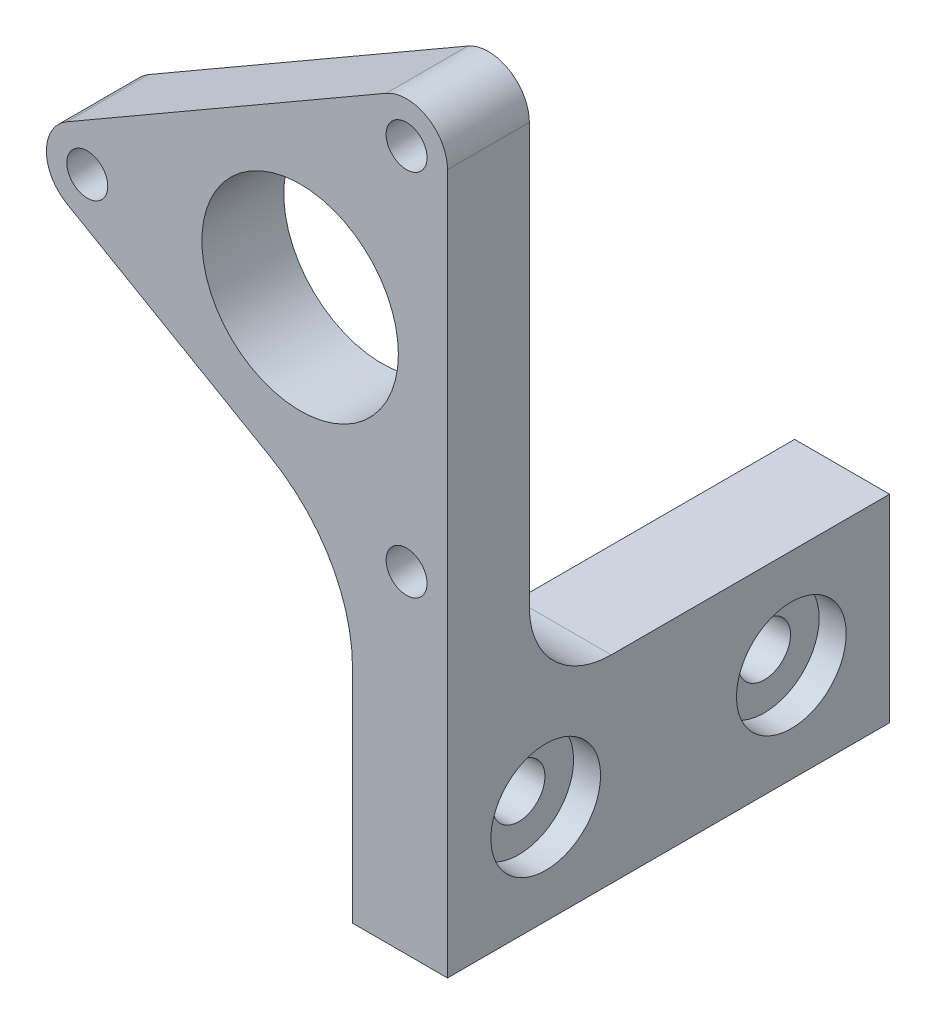
ISO-10303-21;
HEADER;
FILE_DESCRIPTION(('STEP AP214'),'2;1');
FILE_NAME('part.step','',(''),(''),'','','');
FILE_SCHEMA(('AUTOMOTIVE_DESIGN { 1 0 10303 214 1 1 1 1 }'));
ENDSEC;
DATA;
#1=APPLICATION_CONTEXT('core data for automotive mechanical design processes');
#2=APPLICATION_PROTOCOL_DEFINITION('international standard','automotive_design',2000,#1);
#3=PRODUCT_CONTEXT('',#1,'mechanical');
#4=PRODUCT('Part','Part','',(#3));
#5=PRODUCT_RELATED_PRODUCT_CATEGORY('part','',(#4));
#6=PRODUCT_DEFINITION_FORMATION('','',#4);
#7=PRODUCT_DEFINITION_CONTEXT('part definition',#1,'design');
#8=PRODUCT_DEFINITION('design','',#6,#7);
#9=PRODUCT_DEFINITION_SHAPE('','',#8);
#10=(LENGTH_UNIT() NAMED_UNIT(*) SI_UNIT(.MILLI.,.METRE.));
#11=(NAMED_UNIT(*) PLANE_ANGLE_UNIT() SI_UNIT($,.RADIAN.));
#12=(NAMED_UNIT(*) SI_UNIT($,.STERADIAN.) SOLID_ANGLE_UNIT());
#13=UNCERTAINTY_MEASURE_WITH_UNIT(LENGTH_MEASURE(1.E-05),#10,'distance_accuracy_value','');
#14=(GEOMETRIC_REPRESENTATION_CONTEXT(3) GLOBAL_UNCERTAINTY_ASSIGNED_CONTEXT((#13)) GLOBAL_UNIT_ASSIGNED_CONTEXT((#10,
#11,#12)) REPRESENTATION_CONTEXT('',''));
#15=CARTESIAN_POINT('',(0.,0.,0.));
#16=DIRECTION('',(0.,0.,1.));
#17=DIRECTION('',(1.,0.,0.));
#18=AXIS2_PLACEMENT_3D('',#15,#16,#17);
#19=CARTESIAN_POINT('',(9.00000000000005,11.2583302491977,5.));
#20=DIRECTION('',(-1.,0.,0.));
#21=DIRECTION('',(0.,-1.,0.));
#22=AXIS2_PLACEMENT_3D('',#19,#20,#21);
#23=PLANE('',#22);
#24=CARTESIAN_POINT('',(9.00000000000007,-25.4533302491977,-16.));
#25=DIRECTION('',(1.,0.,0.));
#26=DIRECTION('',(0.,0.,-1.));
#27=AXIS2_PLACEMENT_3D('',#24,#25,#26);
#28=CIRCLE('',#27,3.35);
#29=CARTESIAN_POINT('',(9.00000000000007,-25.4533302491977,-19.35));
#30=VERTEX_POINT('',#29);
#31=EDGE_CURVE('E311',#30,#30,#28,.T.);
#32=ORIENTED_EDGE('',*,*,#31,.F.);
#33=EDGE_LOOP('',(#32));
#34=FACE_BOUND('',#33,.T.);
#35=DIRECTION('',(0.,0.,-1.));
#36=VECTOR('',#35,1.);
#37=CARTESIAN_POINT('',(9.00000000000006,-31.4983302491977,5.));
#38=LINE('',#37,#36);
#39=CARTESIAN_POINT('',(9.00000000000006,-31.4983302491977,5.));
#40=VERTEX_POINT('',#39);
#41=CARTESIAN_POINT('',(9.00000000000006,-31.4983302491977,-22.));
#42=VERTEX_POINT('',#41);
#43=EDGE_CURVE('E123',#40,#42,#38,.T.);
#44=ORIENTED_EDGE('',*,*,#43,.T.);
#45=DIRECTION('',(0.,-1.,0.));
#46=VECTOR('',#45,1.);
#47=CARTESIAN_POINT('',(9.00000000000006,-19.4083302491977,-22.));
#48=LINE('',#47,#46);
#49=CARTESIAN_POINT('',(9.00000000000006,-19.4083302491977,-22.));
#50=VERTEX_POINT('',#49);
#51=EDGE_CURVE('E137',#50,#42,#48,.T.);
#52=ORIENTED_EDGE('',*,*,#51,.F.);
#53=DIRECTION('',(0.,0.,1.));
#54=VECTOR('',#53,1.);
#55=CARTESIAN_POINT('',(9.00000000000006,-19.4083302491977,-22.));
#56=LINE('',#55,#54);
#57=CARTESIAN_POINT('',(9.00000000000006,-19.4083302491977,-5.));
#58=VERTEX_POINT('',#57);
#59=EDGE_CURVE('E147',#50,#58,#56,.T.);
#60=ORIENTED_EDGE('',*,*,#59,.T.);
#61=CARTESIAN_POINT('',(9.00000000000006,-14.4083302491977,-5.));
#62=DIRECTION('',(-1.,0.,0.));
#63=DIRECTION('',(0.,-1.,0.));
#64=AXIS2_PLACEMENT_3D('',#61,#62,#63);
#65=CIRCLE('',#64,5.);
#66=CARTESIAN_POINT('',(9.00000000000006,-14.4083302491977,0.));
#67=VERTEX_POINT('',#66);
#68=EDGE_CURVE('E55',#58,#67,#65,.T.);
#69=ORIENTED_EDGE('',*,*,#68,.T.);
#70=DIRECTION('',(0.,1.,0.));
#71=VECTOR('',#70,1.);
#72=CARTESIAN_POINT('',(9.00000000000005,11.2583302491977,0.));
#73=LINE('',#72,#71);
#74=CARTESIAN_POINT('',(9.00000000000005,11.2583302491977,0.));
#75=VERTEX_POINT('',#74);
#76=EDGE_CURVE('E193',#67,#75,#73,.T.);
#77=ORIENTED_EDGE('',*,*,#76,.T.);
#78=DIRECTION('',(0.,0.,-1.));
#79=VECTOR('',#78,1.);
#80=CARTESIAN_POINT('',(9.00000000000005,11.2583302491977,5.));
#81=LINE('',#80,#79);
#82=CARTESIAN_POINT('',(9.00000000000005,11.2583302491977,5.));
#83=VERTEX_POINT('',#82);
#84=EDGE_CURVE('E325',#83,#75,#81,.T.);
#85=ORIENTED_EDGE('',*,*,#84,.F.);
#86=DIRECTION('',(0.,1.,0.));
#87=VECTOR('',#86,1.);
#88=CARTESIAN_POINT('',(9.00000000000006,-11.2583302491977,5.));
#89=LINE('',#88,#87);
#90=EDGE_CURVE('E180',#40,#83,#89,.T.);
#91=ORIENTED_EDGE('',*,*,#90,.F.);
#92=EDGE_LOOP('',(#44,#52,#60,#69,#77,#85,#91));
#93=FACE_BOUND('',#92,.T.);
#94=CARTESIAN_POINT('',(9.00000000000007,-25.4533302491977,-1.));
#95=DIRECTION('',(1.,0.,0.));
#96=DIRECTION('',(0.,0.,-1.));
#97=AXIS2_PLACEMENT_3D('',#94,#95,#96);
#98=CIRCLE('',#97,3.35);
#99=CARTESIAN_POINT('',(9.00000000000007,-25.4533302491977,-4.35));
#100=VERTEX_POINT('',#99);
#101=EDGE_CURVE('E300',#100,#100,#98,.T.);
#102=ORIENTED_EDGE('',*,*,#101,.F.);
#103=EDGE_LOOP('',(#102));
#104=FACE_BOUND('',#103,.T.);
#105=ADVANCED_FACE('F32',(#34,#93,#104),#23,.F.);
#106=CARTESIAN_POINT('',(-6.79999999999994,-18.0133283987163,0.));
#107=DIRECTION('',(0.,0.,1.));
#108=DIRECTION('',(1.,0.,0.));
#109=AXIS2_PLACEMENT_3D('',#106,#107,#108);
#110=PLANE('',#109);
#111=CARTESIAN_POINT('',(-13.,0.,0.));
#112=DIRECTION('',(0.,0.,1.));
#113=DIRECTION('',(1.,0.,0.));
#114=AXIS2_PLACEMENT_3D('',#111,#112,#113);
#115=CIRCLE('',#114,1.25);
#116=CARTESIAN_POINT('',(-11.75,0.,0.));
#117=VERTEX_POINT('',#116);
#118=EDGE_CURVE('E152',#117,#117,#115,.T.);
#119=ORIENTED_EDGE('',*,*,#118,.T.);
#120=EDGE_LOOP('',(#119));
#121=FACE_BOUND('',#120,.T.);
#122=CARTESIAN_POINT('',(6.50000000000006,-11.2583302491977,0.));
#123=DIRECTION('',(0.,0.,1.));
#124=DIRECTION('',(1.,0.,0.));
#125=AXIS2_PLACEMENT_3D('',#122,#123,#124);
#126=CIRCLE('',#125,1.25);
#127=CARTESIAN_POINT('',(7.75000000000006,-11.2583302491977,0.));
#128=VERTEX_POINT('',#127);
#129=EDGE_CURVE('E158',#128,#128,#126,.T.);
#130=ORIENTED_EDGE('',*,*,#129,.T.);
#131=EDGE_LOOP('',(#130));
#132=FACE_BOUND('',#131,.T.);
#133=CARTESIAN_POINT('',(0.,0.,0.));
#134=DIRECTION('',(0.,0.,1.));
#135=DIRECTION('',(1.,0.,0.));
#136=AXIS2_PLACEMENT_3D('',#133,#134,#135);
#137=CIRCLE('',#136,6.);
#138=CARTESIAN_POINT('',(6.,0.,0.));
#139=VERTEX_POINT('',#138);
#140=EDGE_CURVE('E164',#139,#139,#137,.T.);
#141=ORIENTED_EDGE('',*,*,#140,.T.);
#142=EDGE_LOOP('',(#141));
#143=FACE_BOUND('',#142,.T.);
#144=CARTESIAN_POINT('',(6.50000000000005,11.2583302491977,0.));
#145=DIRECTION('',(0.,0.,1.));
#146=DIRECTION('',(1.,0.,0.));
#147=AXIS2_PLACEMENT_3D('',#144,#145,#146);
#148=CIRCLE('',#147,1.25);
#149=CARTESIAN_POINT('',(7.75000000000005,11.2583302491977,0.));
#150=VERTEX_POINT('',#149);
#151=EDGE_CURVE('E151',#150,#150,#148,.T.);
#152=ORIENTED_EDGE('',*,*,#151,.T.);
#153=EDGE_LOOP('',(#152));
#154=FACE_BOUND('',#153,.T.);
#155=ORIENTED_EDGE('',*,*,#76,.F.);
#156=DIRECTION('',(1.,0.,0.));
#157=VECTOR('',#156,1.);
#158=CARTESIAN_POINT('',(3.20000000000006,-14.4083302491977,0.));
#159=LINE('',#158,#157);
#160=CARTESIAN_POINT('',(2.52759284820946,-14.4083302491977,0.));
#161=VERTEX_POINT('',#160);
#162=EDGE_CURVE('E203',#67,#161,#159,.F.);
#163=ORIENTED_EDGE('',*,*,#162,.T.);
#164=CARTESIAN_POINT('',(-6.79999999999994,-18.0133283987163,0.));
#165=DIRECTION('',(0.,0.,-1.));
#166=DIRECTION('',(1.,0.,0.));
#167=AXIS2_PLACEMENT_3D('',#164,#165,#166);
#168=CIRCLE('',#167,10.);
#169=CARTESIAN_POINT('',(-1.79999999999997,-9.35307436087192,0.));
#170=VERTEX_POINT('',#169);
#171=EDGE_CURVE('E170',#170,#161,#168,.T.);
#172=ORIENTED_EDGE('',*,*,#171,.F.);
#173=DIRECTION('',(0.86602540378444,-0.499999999999998,0.));
#174=VECTOR('',#173,1.);
#175=CARTESIAN_POINT('',(-14.25,-2.1650635094611,0.));
#176=LINE('',#175,#174);
#177=CARTESIAN_POINT('',(-14.25,-2.1650635094611,0.));
#178=VERTEX_POINT('',#177);
#179=EDGE_CURVE('E177',#178,#170,#176,.T.);
#180=ORIENTED_EDGE('',*,*,#179,.F.);
#181=CARTESIAN_POINT('',(-13.,0.,0.));
#182=DIRECTION('',(0.,0.,1.));
#183=DIRECTION('',(1.,0.,0.));
#184=AXIS2_PLACEMENT_3D('',#181,#182,#183);
#185=CIRCLE('',#184,2.5);
#186=CARTESIAN_POINT('',(-14.25,2.1650635094611,0.));
#187=VERTEX_POINT('',#186);
#188=EDGE_CURVE('E368',#187,#178,#185,.T.);
#189=ORIENTED_EDGE('',*,*,#188,.F.);
#190=DIRECTION('',(-0.86602540378444,-0.499999999999998,0.));
#191=VECTOR('',#190,1.);
#192=CARTESIAN_POINT('',(-14.25,2.1650635094611,0.));
#193=LINE('',#192,#191);
#194=CARTESIAN_POINT('',(5.25000000000006,13.4233937586588,0.));
#195=VERTEX_POINT('',#194);
#196=EDGE_CURVE('E365',#195,#187,#193,.T.);
#197=ORIENTED_EDGE('',*,*,#196,.F.);
#198=CARTESIAN_POINT('',(6.50000000000004,11.2583302491977,0.));
#199=DIRECTION('',(0.,0.,1.));
#200=DIRECTION('',(-1.,0.,0.));
#201=AXIS2_PLACEMENT_3D('',#198,#199,#200);
#202=CIRCLE('',#201,2.50000000000001);
#203=EDGE_CURVE('E196',#75,#195,#202,.T.);
#204=ORIENTED_EDGE('',*,*,#203,.F.);
#205=EDGE_LOOP('',(#155,#163,#172,#180,#189,#197,#204));
#206=FACE_BOUND('',#205,.T.);
#207=ADVANCED_FACE('F222',(#121,#132,#143,#154,#206),#110,.F.);
#208=CARTESIAN_POINT('',(-6.79999999999994,-18.0133283987163,5.));
#209=DIRECTION('',(0.,0.,1.));
#210=DIRECTION('',(1.,0.,0.));
#211=AXIS2_PLACEMENT_3D('',#208,#209,#210);
#212=PLANE('',#211);
#213=CARTESIAN_POINT('',(6.50000000000005,11.2583302491977,5.));
#214=DIRECTION('',(0.,0.,1.));
#215=DIRECTION('',(1.,0.,0.));
#216=AXIS2_PLACEMENT_3D('',#213,#214,#215);
#217=CIRCLE('',#216,1.25);
#218=CARTESIAN_POINT('',(7.75000000000005,11.2583302491977,5.));
#219=VERTEX_POINT('',#218);
#220=EDGE_CURVE('E155',#219,#219,#217,.T.);
#221=ORIENTED_EDGE('',*,*,#220,.F.);
#222=EDGE_LOOP('',(#221));
#223=FACE_BOUND('',#222,.T.);
#224=CARTESIAN_POINT('',(0.,0.,5.));
#225=DIRECTION('',(0.,0.,1.));
#226=DIRECTION('',(1.,0.,0.));
#227=AXIS2_PLACEMENT_3D('',#224,#225,#226);
#228=CIRCLE('',#227,6.);
#229=CARTESIAN_POINT('',(6.,0.,5.));
#230=VERTEX_POINT('',#229);
#231=EDGE_CURVE('E167',#230,#230,#228,.T.);
#232=ORIENTED_EDGE('',*,*,#231,.F.);
#233=EDGE_LOOP('',(#232));
#234=FACE_BOUND('',#233,.T.);
#235=CARTESIAN_POINT('',(-6.79999999999994,-18.0133283987163,5.));
#236=DIRECTION('',(0.,0.,-1.));
#237=DIRECTION('',(1.,0.,0.));
#238=AXIS2_PLACEMENT_3D('',#235,#236,#237);
#239=CIRCLE('',#238,10.);
#240=CARTESIAN_POINT('',(-1.79999999999997,-9.35307436087192,5.));
#241=VERTEX_POINT('',#240);
#242=CARTESIAN_POINT('',(3.20000000000006,-18.0133283987163,5.));
#243=VERTEX_POINT('',#242);
#244=EDGE_CURVE('E173',#241,#243,#239,.T.);
#245=ORIENTED_EDGE('',*,*,#244,.T.);
#246=DIRECTION('',(0.,-1.,0.));
#247=VECTOR('',#246,1.);
#248=CARTESIAN_POINT('',(3.20000000000006,-19.4083302491977,5.));
#249=LINE('',#248,#247);
#250=CARTESIAN_POINT('',(3.20000000000006,-31.4983302491977,5.));
#251=VERTEX_POINT('',#250);
#252=EDGE_CURVE('E176',#243,#251,#249,.T.);
#253=ORIENTED_EDGE('',*,*,#252,.T.);
#254=DIRECTION('',(1.,0.,0.));
#255=VECTOR('',#254,1.);
#256=CARTESIAN_POINT('',(9.00000000000006,-31.4983302491977,5.));
#257=LINE('',#256,#255);
#258=EDGE_CURVE('E122',#251,#40,#257,.T.);
#259=ORIENTED_EDGE('',*,*,#258,.T.);
#260=ORIENTED_EDGE('',*,*,#90,.T.);
#261=CARTESIAN_POINT('',(6.50000000000004,11.2583302491977,5.));
#262=DIRECTION('',(0.,0.,1.));
#263=DIRECTION('',(-1.,0.,0.));
#264=AXIS2_PLACEMENT_3D('',#261,#262,#263);
#265=CIRCLE('',#264,2.50000000000001);
#266=CARTESIAN_POINT('',(5.25000000000006,13.4233937586588,5.));
#267=VERTEX_POINT('',#266);
#268=EDGE_CURVE('E182',#83,#267,#265,.T.);
#269=ORIENTED_EDGE('',*,*,#268,.T.);
#270=DIRECTION('',(-0.86602540378444,-0.499999999999998,0.));
#271=VECTOR('',#270,1.);
#272=CARTESIAN_POINT('',(-14.25,2.1650635094611,5.));
#273=LINE('',#272,#271);
#274=CARTESIAN_POINT('',(-14.25,2.1650635094611,5.));
#275=VERTEX_POINT('',#274);
#276=EDGE_CURVE('E184',#267,#275,#273,.T.);
#277=ORIENTED_EDGE('',*,*,#276,.T.);
#278=CARTESIAN_POINT('',(-13.,0.,5.));
#279=DIRECTION('',(0.,0.,1.));
#280=DIRECTION('',(1.,0.,0.));
#281=AXIS2_PLACEMENT_3D('',#278,#279,#280);
#282=CIRCLE('',#281,2.5);
#283=CARTESIAN_POINT('',(-14.25,-2.1650635094611,5.));
#284=VERTEX_POINT('',#283);
#285=EDGE_CURVE('E186',#275,#284,#282,.T.);
#286=ORIENTED_EDGE('',*,*,#285,.T.);
#287=DIRECTION('',(0.86602540378444,-0.499999999999998,0.));
#288=VECTOR('',#287,1.);
#289=CARTESIAN_POINT('',(-14.25,-2.1650635094611,5.));
#290=LINE('',#289,#288);
#291=EDGE_CURVE('E188',#284,#241,#290,.T.);
#292=ORIENTED_EDGE('',*,*,#291,.T.);
#293=EDGE_LOOP('',(#245,#253,#259,#260,#269,#277,#286,#292));
#294=FACE_BOUND('',#293,.T.);
#295=CARTESIAN_POINT('',(6.50000000000006,-11.2583302491977,5.));
#296=DIRECTION('',(0.,0.,1.));
#297=DIRECTION('',(1.,0.,0.));
#298=AXIS2_PLACEMENT_3D('',#295,#296,#297);
#299=CIRCLE('',#298,1.25);
#300=CARTESIAN_POINT('',(7.75000000000006,-11.2583302491977,5.));
#301=VERTEX_POINT('',#300);
#302=EDGE_CURVE('E161',#301,#301,#299,.T.);
#303=ORIENTED_EDGE('',*,*,#302,.F.);
#304=EDGE_LOOP('',(#303));
#305=FACE_BOUND('',#304,.T.);
#306=CARTESIAN_POINT('',(-13.,0.,5.));
#307=DIRECTION('',(0.,0.,1.));
#308=DIRECTION('',(1.,0.,0.));
#309=AXIS2_PLACEMENT_3D('',#306,#307,#308);
#310=CIRCLE('',#309,1.25);
#311=CARTESIAN_POINT('',(-11.75,0.,5.));
#312=VERTEX_POINT('',#311);
#313=EDGE_CURVE('E148',#312,#312,#310,.T.);
#314=ORIENTED_EDGE('',*,*,#313,.F.);
#315=EDGE_LOOP('',(#314));
#316=FACE_BOUND('',#315,.T.);
#317=ADVANCED_FACE('F212',(#223,#234,#294,#305,#316),#212,.T.);
#318=CARTESIAN_POINT('',(-6.79999999999994,-18.0133283987163,5.));
#319=DIRECTION('',(0.,0.,-1.));
#320=DIRECTION('',(-1.,0.,0.));
#321=AXIS2_PLACEMENT_3D('',#318,#319,#320);
#322=CYLINDRICAL_SURFACE('',#321,10.);
#323=ORIENTED_EDGE('',*,*,#171,.T.);
#324=CARTESIAN_POINT('',(2.52759284820946,-14.4083302491977,0.));
#325=CARTESIAN_POINT('',(2.57505349169204,-14.5310702691906,1.8176382911117E-05));
#326=CARTESIAN_POINT('',(2.62006035560793,-14.6547848229578,-0.0045193791678772));
#327=CARTESIAN_POINT('',(2.70498878101354,-14.9032929106537,-0.0230034729052741));
#328=CARTESIAN_POINT('',(2.74490870994727,-15.0280867773149,-0.0369530226980955));
#329=CARTESIAN_POINT('',(2.8194060029538,-15.2776398913905,-0.0745343519197054));
#330=CARTESIAN_POINT('',(2.85399030556006,-15.402398969535,-0.0981534083253944));
#331=CARTESIAN_POINT('',(2.91781590553004,-15.6510170209932,-0.155209998934137));
#332=CARTESIAN_POINT('',(2.94705803824179,-15.77487613212,-0.188645995939753));
#333=CARTESIAN_POINT('',(3.00033372633877,-16.0210035107996,-0.265451563331926));
#334=CARTESIAN_POINT('',(3.0243530451927,-16.1432665968955,-0.308847638276383));
#335=CARTESIAN_POINT('',(3.06726737410603,-16.3848068781742,-0.405388326561697));
#336=CARTESIAN_POINT('',(3.08616234972129,-16.5040840532818,-0.458533005425436));
#337=CARTESIAN_POINT('',(3.11911983384258,-16.7385473067531,-0.574261078307648));
#338=CARTESIAN_POINT('',(3.13318593259965,-16.8537363672304,-0.636837409896639));
#339=CARTESIAN_POINT('',(3.15691326996856,-17.0791311119872,-0.771048407593639));
#340=CARTESIAN_POINT('',(3.16657573537836,-17.189338176473,-0.84268054375389));
#341=CARTESIAN_POINT('',(3.18353401384334,-17.4253783122695,-1.00972935043395));
#342=CARTESIAN_POINT('',(3.18997200608579,-17.5499374662948,-1.10703920463396));
#343=CARTESIAN_POINT('',(3.19820934361145,-17.7892557615898,-1.31294980793586));
#344=CARTESIAN_POINT('',(3.20001422483181,-17.9040264400041,-1.42153692060294));
#345=CARTESIAN_POINT('',(3.20000000000006,-18.0133283987163,-1.5353227651097));
#346=B_SPLINE_CURVE_WITH_KNOTS('',3,(#324,#325,#326,#327,#328,#329,#330,#331,#332,#333,#334,
#335,#336,#337,#338,#339,#340,#341,#342,#343,#344,#345),.UNSPECIFIED.,.F.,.F.,(4,2,2,2,2,2,2,2,
2,2,4),(0.,0.394720416909895,0.789567194560039,1.18389609875867,1.57816328939311,
1.97349207708858,2.36882352198817,2.76386039968484,3.15878715760525,3.63257193012094,
4.10579033024235),.UNSPECIFIED.);
#347=CARTESIAN_POINT('',(3.20000000000006,-18.0133283987163,-1.5353227651097));
#348=VERTEX_POINT('',#347);
#349=EDGE_CURVE('E41',#161,#348,#346,.T.);
#350=ORIENTED_EDGE('',*,*,#349,.T.);
#351=DIRECTION('',(0.,0.,-1.));
#352=VECTOR('',#351,1.);
#353=CARTESIAN_POINT('',(3.20000000000006,-18.0133283987163,5.));
#354=LINE('',#353,#352);
#355=EDGE_CURVE('E47',#243,#348,#354,.T.);
#356=ORIENTED_EDGE('',*,*,#355,.F.);
#357=ORIENTED_EDGE('',*,*,#244,.F.);
#358=DIRECTION('',(0.,0.,-1.));
#359=VECTOR('',#358,1.);
#360=CARTESIAN_POINT('',(-1.79999999999997,-9.35307436087192,5.));
#361=LINE('',#360,#359);
#362=EDGE_CURVE('E190',#241,#170,#361,.T.);
#363=ORIENTED_EDGE('',*,*,#362,.T.);
#364=EDGE_LOOP('',(#323,#350,#356,#357,#363));
#365=FACE_BOUND('',#364,.T.);
#366=ADVANCED_FACE('F208',(#365),#322,.F.);
#367=CARTESIAN_POINT('',(3.20000000000006,-31.4983302491977,5.));
#368=DIRECTION('',(1.,0.,0.));
#369=DIRECTION('',(0.,1.,0.));
#370=AXIS2_PLACEMENT_3D('',#367,#368,#369);
#371=PLANE('',#370);
#372=CARTESIAN_POINT('',(3.20000000000006,-25.4533302491977,-1.));
#373=DIRECTION('',(1.,0.,0.));
#374=DIRECTION('',(0.,1.,0.));
#375=AXIS2_PLACEMENT_3D('',#372,#373,#374);
#376=CIRCLE('',#375,1.6);
#377=CARTESIAN_POINT('',(3.20000000000006,-23.8533302491977,-1.));
#378=VERTEX_POINT('',#377);
#379=EDGE_CURVE('E308',#378,#378,#376,.T.);
#380=ORIENTED_EDGE('',*,*,#379,.T.);
#381=EDGE_LOOP('',(#380));
#382=FACE_BOUND('',#381,.T.);
#383=CARTESIAN_POINT('',(3.20000000000006,-25.4533302491977,-16.));
#384=DIRECTION('',(1.,0.,0.));
#385=DIRECTION('',(0.,1.,0.));
#386=AXIS2_PLACEMENT_3D('',#383,#384,#385);
#387=CIRCLE('',#386,1.6);
#388=CARTESIAN_POINT('',(3.20000000000006,-23.8533302491977,-16.));
#389=VERTEX_POINT('',#388);
#390=EDGE_CURVE('E138',#389,#389,#387,.T.);
#391=ORIENTED_EDGE('',*,*,#390,.T.);
#392=EDGE_LOOP('',(#391));
#393=FACE_BOUND('',#392,.T.);
#394=ORIENTED_EDGE('',*,*,#355,.T.);
#395=CARTESIAN_POINT('',(3.20000000000005,-14.4083302491977,-5.));
#396=DIRECTION('',(1.,0.,0.));
#397=DIRECTION('',(0.,1.,0.));
#398=AXIS2_PLACEMENT_3D('',#395,#396,#397);
#399=CIRCLE('',#398,5.);
#400=CARTESIAN_POINT('',(3.20000000000006,-19.4083302491977,-5.));
#401=VERTEX_POINT('',#400);
#402=EDGE_CURVE('E11',#348,#401,#399,.T.);
#403=ORIENTED_EDGE('',*,*,#402,.T.);
#404=DIRECTION('',(0.,0.,1.));
#405=VECTOR('',#404,1.);
#406=CARTESIAN_POINT('',(3.20000000000006,-19.4083302491977,-22.));
#407=LINE('',#406,#405);
#408=CARTESIAN_POINT('',(3.20000000000006,-19.4083302491977,-22.));
#409=VERTEX_POINT('',#408);
#410=EDGE_CURVE('E129',#409,#401,#407,.T.);
#411=ORIENTED_EDGE('',*,*,#410,.F.);
#412=DIRECTION('',(0.,1.,0.));
#413=VECTOR('',#412,1.);
#414=CARTESIAN_POINT('',(3.20000000000006,-31.4983302491977,-22.));
#415=LINE('',#414,#413);
#416=CARTESIAN_POINT('',(3.20000000000006,-31.4983302491977,-22.));
#417=VERTEX_POINT('',#416);
#418=EDGE_CURVE('E126',#417,#409,#415,.T.);
#419=ORIENTED_EDGE('',*,*,#418,.F.);
#420=DIRECTION('',(0.,0.,-1.));
#421=VECTOR('',#420,1.);
#422=CARTESIAN_POINT('',(3.20000000000006,-31.4983302491977,5.));
#423=LINE('',#422,#421);
#424=EDGE_CURVE('E116',#251,#417,#423,.T.);
#425=ORIENTED_EDGE('',*,*,#424,.F.);
#426=ORIENTED_EDGE('',*,*,#252,.F.);
#427=EDGE_LOOP('',(#394,#403,#411,#419,#425,#426));
#428=FACE_BOUND('',#427,.T.);
#429=ADVANCED_FACE('F127',(#382,#393,#428),#371,.F.);
#430=CARTESIAN_POINT('',(9.00000000000006,-31.4983302491977,5.));
#431=DIRECTION('',(0.,1.,0.));
#432=DIRECTION('',(0.,0.,1.));
#433=AXIS2_PLACEMENT_3D('',#430,#431,#432);
#434=PLANE('',#433);
#435=ORIENTED_EDGE('',*,*,#424,.T.);
#436=DIRECTION('',(-1.,0.,0.));
#437=VECTOR('',#436,1.);
#438=CARTESIAN_POINT('',(9.00000000000006,-31.4983302491977,-22.));
#439=LINE('',#438,#437);
#440=EDGE_CURVE('E121',#42,#417,#439,.T.);
#441=ORIENTED_EDGE('',*,*,#440,.F.);
#442=ORIENTED_EDGE('',*,*,#43,.F.);
#443=ORIENTED_EDGE('',*,*,#258,.F.);
#444=EDGE_LOOP('',(#435,#441,#442,#443));
#445=FACE_BOUND('',#444,.T.);
#446=ADVANCED_FACE('F118',(#445),#434,.F.);
#447=CARTESIAN_POINT('',(6.50000000000004,11.2583302491977,5.));
#448=DIRECTION('',(0.,0.,-1.));
#449=DIRECTION('',(-1.,0.,0.));
#450=AXIS2_PLACEMENT_3D('',#447,#448,#449);
#451=CYLINDRICAL_SURFACE('',#450,2.50000000000001);
#452=ORIENTED_EDGE('',*,*,#203,.T.);
#453=DIRECTION('',(0.,0.,-1.));
#454=VECTOR('',#453,1.);
#455=CARTESIAN_POINT('',(5.25000000000006,13.4233937586588,5.));
#456=LINE('',#455,#454);
#457=EDGE_CURVE('E328',#267,#195,#456,.T.);
#458=ORIENTED_EDGE('',*,*,#457,.F.);
#459=ORIENTED_EDGE('',*,*,#268,.F.);
#460=ORIENTED_EDGE('',*,*,#84,.T.);
#461=EDGE_LOOP('',(#452,#458,#459,#460));
#462=FACE_BOUND('',#461,.T.);
#463=ADVANCED_FACE('F219',(#462),#451,.T.);
#464=CARTESIAN_POINT('',(-14.25,2.1650635094611,5.));
#465=DIRECTION('',(0.499999999999998,-0.86602540378444,0.));
#466=DIRECTION('',(0.86602540378444,0.499999999999998,0.));
#467=AXIS2_PLACEMENT_3D('',#464,#465,#466);
#468=PLANE('',#467);
#469=ORIENTED_EDGE('',*,*,#196,.T.);
#470=DIRECTION('',(0.,0.,-1.));
#471=VECTOR('',#470,1.);
#472=CARTESIAN_POINT('',(-14.25,2.1650635094611,5.));
#473=LINE('',#472,#471);
#474=EDGE_CURVE('E354',#275,#187,#473,.T.);
#475=ORIENTED_EDGE('',*,*,#474,.F.);
#476=ORIENTED_EDGE('',*,*,#276,.F.);
#477=ORIENTED_EDGE('',*,*,#457,.T.);
#478=EDGE_LOOP('',(#469,#475,#476,#477));
#479=FACE_BOUND('',#478,.T.);
#480=ADVANCED_FACE('F226',(#479),#468,.F.);
#481=CARTESIAN_POINT('',(-13.,0.,5.));
#482=DIRECTION('',(0.,0.,-1.));
#483=DIRECTION('',(-1.,0.,0.));
#484=AXIS2_PLACEMENT_3D('',#481,#482,#483);
#485=CYLINDRICAL_SURFACE('',#484,2.5);
#486=ORIENTED_EDGE('',*,*,#188,.T.);
#487=DIRECTION('',(0.,0.,-1.));
#488=VECTOR('',#487,1.);
#489=CARTESIAN_POINT('',(-14.25,-2.1650635094611,5.));
#490=LINE('',#489,#488);
#491=EDGE_CURVE('E351',#284,#178,#490,.T.);
#492=ORIENTED_EDGE('',*,*,#491,.F.);
#493=ORIENTED_EDGE('',*,*,#285,.F.);
#494=ORIENTED_EDGE('',*,*,#474,.T.);
#495=EDGE_LOOP('',(#486,#492,#493,#494));
#496=FACE_BOUND('',#495,.T.);
#497=ADVANCED_FACE('F230',(#496),#485,.T.);
#498=CARTESIAN_POINT('',(-14.25,-2.1650635094611,5.));
#499=DIRECTION('',(0.499999999999998,0.86602540378444,0.));
#500=DIRECTION('',(-0.86602540378444,0.499999999999998,0.));
#501=AXIS2_PLACEMENT_3D('',#498,#499,#500);
#502=PLANE('',#501);
#503=ORIENTED_EDGE('',*,*,#179,.T.);
#504=ORIENTED_EDGE('',*,*,#362,.F.);
#505=ORIENTED_EDGE('',*,*,#291,.F.);
#506=ORIENTED_EDGE('',*,*,#491,.T.);
#507=EDGE_LOOP('',(#503,#504,#505,#506));
#508=FACE_BOUND('',#507,.T.);
#509=ADVANCED_FACE('F234',(#508),#502,.F.);
#510=CARTESIAN_POINT('',(0.,0.,5.));
#511=DIRECTION('',(0.,0.,-1.));
#512=DIRECTION('',(-1.,0.,0.));
#513=AXIS2_PLACEMENT_3D('',#510,#511,#512);
#514=CYLINDRICAL_SURFACE('',#513,6.);
#515=ORIENTED_EDGE('',*,*,#231,.T.);
#516=EDGE_LOOP('',(#515));
#517=FACE_BOUND('',#516,.T.);
#518=ORIENTED_EDGE('',*,*,#140,.F.);
#519=EDGE_LOOP('',(#518));
#520=FACE_BOUND('',#519,.T.);
#521=ADVANCED_FACE('F238',(#517,#520),#514,.F.);
#522=CARTESIAN_POINT('',(6.50000000000006,-11.2583302491977,5.));
#523=DIRECTION('',(0.,0.,-1.));
#524=DIRECTION('',(-1.,0.,0.));
#525=AXIS2_PLACEMENT_3D('',#522,#523,#524);
#526=CYLINDRICAL_SURFACE('',#525,1.25);
#527=ORIENTED_EDGE('',*,*,#302,.T.);
#528=EDGE_LOOP('',(#527));
#529=FACE_BOUND('',#528,.T.);
#530=ORIENTED_EDGE('',*,*,#129,.F.);
#531=EDGE_LOOP('',(#530));
#532=FACE_BOUND('',#531,.T.);
#533=ADVANCED_FACE('F248',(#529,#532),#526,.F.);
#534=CARTESIAN_POINT('',(6.50000000000005,11.2583302491977,5.));
#535=DIRECTION('',(0.,0.,-1.));
#536=DIRECTION('',(-1.,0.,0.));
#537=AXIS2_PLACEMENT_3D('',#534,#535,#536);
#538=CYLINDRICAL_SURFACE('',#537,1.25);
#539=ORIENTED_EDGE('',*,*,#220,.T.);
#540=EDGE_LOOP('',(#539));
#541=FACE_BOUND('',#540,.T.);
#542=ORIENTED_EDGE('',*,*,#151,.F.);
#543=EDGE_LOOP('',(#542));
#544=FACE_BOUND('',#543,.T.);
#545=ADVANCED_FACE('F252',(#541,#544),#538,.F.);
#546=CARTESIAN_POINT('',(-13.,0.,5.));
#547=DIRECTION('',(0.,0.,-1.));
#548=DIRECTION('',(-1.,0.,0.));
#549=AXIS2_PLACEMENT_3D('',#546,#547,#548);
#550=CYLINDRICAL_SURFACE('',#549,1.25);
#551=ORIENTED_EDGE('',*,*,#313,.T.);
#552=EDGE_LOOP('',(#551));
#553=FACE_BOUND('',#552,.T.);
#554=ORIENTED_EDGE('',*,*,#118,.F.);
#555=EDGE_LOOP('',(#554));
#556=FACE_BOUND('',#555,.T.);
#557=ADVANCED_FACE('F256',(#553,#556),#550,.F.);
#558=CARTESIAN_POINT('',(3.20000000000006,-19.4083302491977,-22.));
#559=DIRECTION('',(0.,-1.,0.));
#560=DIRECTION('',(0.,0.,-1.));
#561=AXIS2_PLACEMENT_3D('',#558,#559,#560);
#562=PLANE('',#561);
#563=ORIENTED_EDGE('',*,*,#410,.T.);
#564=DIRECTION('',(1.,0.,0.));
#565=VECTOR('',#564,1.);
#566=CARTESIAN_POINT('',(9.00000000000006,-19.4083302491977,-5.));
#567=LINE('',#566,#565);
#568=EDGE_CURVE('E201',#401,#58,#567,.T.);
#569=ORIENTED_EDGE('',*,*,#568,.T.);
#570=ORIENTED_EDGE('',*,*,#59,.F.);
#571=DIRECTION('',(1.,0.,0.));
#572=VECTOR('',#571,1.);
#573=CARTESIAN_POINT('',(3.20000000000006,-19.4083302491977,-22.));
#574=LINE('',#573,#572);
#575=EDGE_CURVE('E132',#409,#50,#574,.T.);
#576=ORIENTED_EDGE('',*,*,#575,.F.);
#577=EDGE_LOOP('',(#563,#569,#570,#576));
#578=FACE_BOUND('',#577,.T.);
#579=ADVANCED_FACE('F260',(#578),#562,.F.);
#580=CARTESIAN_POINT('',(0.,0.,-22.));
#581=DIRECTION('',(0.,0.,-1.));
#582=DIRECTION('',(-1.,0.,0.));
#583=AXIS2_PLACEMENT_3D('',#580,#581,#582);
#584=PLANE('',#583);
#585=ORIENTED_EDGE('',*,*,#440,.T.);
#586=ORIENTED_EDGE('',*,*,#418,.T.);
#587=ORIENTED_EDGE('',*,*,#575,.T.);
#588=ORIENTED_EDGE('',*,*,#51,.T.);
#589=EDGE_LOOP('',(#585,#586,#587,#588));
#590=FACE_BOUND('',#589,.T.);
#591=ADVANCED_FACE('F135',(#590),#584,.T.);
#592=CARTESIAN_POINT('',(9.00000000000007,-25.4533302491977,-16.));
#593=DIRECTION('',(1.,0.,0.));
#594=DIRECTION('',(0.,0.,-1.));
#595=AXIS2_PLACEMENT_3D('',#592,#593,#594);
#596=CYLINDRICAL_SURFACE('',#595,1.6);
#597=ORIENTED_EDGE('',*,*,#390,.F.);
#598=EDGE_LOOP('',(#597));
#599=FACE_BOUND('',#598,.T.);
#600=CARTESIAN_POINT('',(7.35000000000007,-25.4533302491977,-16.));
#601=DIRECTION('',(1.,0.,0.));
#602=DIRECTION('',(0.,0.,-1.));
#603=AXIS2_PLACEMENT_3D('',#600,#601,#602);
#604=CIRCLE('',#603,1.6);
#605=CARTESIAN_POINT('',(7.35000000000007,-25.4533302491977,-17.6));
#606=VERTEX_POINT('',#605);
#607=EDGE_CURVE('E141',#606,#606,#604,.T.);
#608=ORIENTED_EDGE('',*,*,#607,.T.);
#609=EDGE_LOOP('',(#608));
#610=FACE_BOUND('',#609,.T.);
#611=ADVANCED_FACE('F267',(#599,#610),#596,.F.);
#612=CARTESIAN_POINT('',(7.35000000000007,-23.8533302491977,-16.));
#613=DIRECTION('',(-1.,0.,0.));
#614=DIRECTION('',(0.,0.,1.));
#615=AXIS2_PLACEMENT_3D('',#612,#613,#614);
#616=PLANE('',#615);
#617=ORIENTED_EDGE('',*,*,#607,.F.);
#618=EDGE_LOOP('',(#617));
#619=FACE_BOUND('',#618,.T.);
#620=CARTESIAN_POINT('',(7.35000000000007,-25.4533302491977,-16.));
#621=DIRECTION('',(1.,0.,0.));
#622=DIRECTION('',(0.,0.,-1.));
#623=AXIS2_PLACEMENT_3D('',#620,#621,#622);
#624=CIRCLE('',#623,3.35);
#625=CARTESIAN_POINT('',(7.35000000000007,-25.4533302491977,-19.35));
#626=VERTEX_POINT('',#625);
#627=EDGE_CURVE('E314',#626,#626,#624,.T.);
#628=ORIENTED_EDGE('',*,*,#627,.T.);
#629=EDGE_LOOP('',(#628));
#630=FACE_BOUND('',#629,.T.);
#631=ADVANCED_FACE('F270',(#619,#630),#616,.F.);
#632=CARTESIAN_POINT('',(9.00000000000007,-25.4533302491977,-16.));
#633=DIRECTION('',(1.,0.,0.));
#634=DIRECTION('',(0.,0.,-1.));
#635=AXIS2_PLACEMENT_3D('',#632,#633,#634);
#636=CYLINDRICAL_SURFACE('',#635,3.35);
#637=ORIENTED_EDGE('',*,*,#627,.F.);
#638=EDGE_LOOP('',(#637));
#639=FACE_BOUND('',#638,.T.);
#640=ORIENTED_EDGE('',*,*,#31,.T.);
#641=EDGE_LOOP('',(#640));
#642=FACE_BOUND('',#641,.T.);
#643=ADVANCED_FACE('F274',(#639,#642),#636,.F.);
#644=CARTESIAN_POINT('',(9.00000000000007,-25.4533302491977,-1.));
#645=DIRECTION('',(1.,0.,0.));
#646=DIRECTION('',(0.,0.,-1.));
#647=AXIS2_PLACEMENT_3D('',#644,#645,#646);
#648=CYLINDRICAL_SURFACE('',#647,1.6);
#649=ORIENTED_EDGE('',*,*,#379,.F.);
#650=EDGE_LOOP('',(#649));
#651=FACE_BOUND('',#650,.T.);
#652=CARTESIAN_POINT('',(7.35000000000007,-25.4533302491977,-1.));
#653=DIRECTION('',(1.,0.,0.));
#654=DIRECTION('',(0.,0.,-1.));
#655=AXIS2_PLACEMENT_3D('',#652,#653,#654);
#656=CIRCLE('',#655,1.6);
#657=CARTESIAN_POINT('',(7.35000000000007,-25.4533302491977,-2.6));
#658=VERTEX_POINT('',#657);
#659=EDGE_CURVE('E303',#658,#658,#656,.T.);
#660=ORIENTED_EDGE('',*,*,#659,.T.);
#661=EDGE_LOOP('',(#660));
#662=FACE_BOUND('',#661,.T.);
#663=ADVANCED_FACE('F278',(#651,#662),#648,.F.);
#664=CARTESIAN_POINT('',(7.35000000000007,-23.8533302491977,-1.));
#665=DIRECTION('',(-1.,0.,0.));
#666=DIRECTION('',(0.,0.,1.));
#667=AXIS2_PLACEMENT_3D('',#664,#665,#666);
#668=PLANE('',#667);
#669=ORIENTED_EDGE('',*,*,#659,.F.);
#670=EDGE_LOOP('',(#669));
#671=FACE_BOUND('',#670,.T.);
#672=CARTESIAN_POINT('',(7.35000000000007,-25.4533302491977,-1.));
#673=DIRECTION('',(1.,0.,0.));
#674=DIRECTION('',(0.,0.,-1.));
#675=AXIS2_PLACEMENT_3D('',#672,#673,#674);
#676=CIRCLE('',#675,3.35);
#677=CARTESIAN_POINT('',(7.35000000000007,-25.4533302491977,-4.35));
#678=VERTEX_POINT('',#677);
#679=EDGE_CURVE('E297',#678,#678,#676,.T.);
#680=ORIENTED_EDGE('',*,*,#679,.T.);
#681=EDGE_LOOP('',(#680));
#682=FACE_BOUND('',#681,.T.);
#683=ADVANCED_FACE('F282',(#671,#682),#668,.F.);
#684=CARTESIAN_POINT('',(9.00000000000007,-25.4533302491977,-1.));
#685=DIRECTION('',(1.,0.,0.));
#686=DIRECTION('',(0.,0.,-1.));
#687=AXIS2_PLACEMENT_3D('',#684,#685,#686);
#688=CYLINDRICAL_SURFACE('',#687,3.35);
#689=ORIENTED_EDGE('',*,*,#679,.F.);
#690=EDGE_LOOP('',(#689));
#691=FACE_BOUND('',#690,.T.);
#692=ORIENTED_EDGE('',*,*,#101,.T.);
#693=EDGE_LOOP('',(#692));
#694=FACE_BOUND('',#693,.T.);
#695=ADVANCED_FACE('F286',(#691,#694),#688,.F.);
#696=CARTESIAN_POINT('',(3.20000000000006,-14.4083302491977,-5.));
#697=DIRECTION('',(-1.,0.,0.));
#698=DIRECTION('',(0.,0.,1.));
#699=AXIS2_PLACEMENT_3D('',#696,#697,#698);
#700=CYLINDRICAL_SURFACE('',#699,5.);
#701=ORIENTED_EDGE('',*,*,#349,.F.);
#702=ORIENTED_EDGE('',*,*,#162,.F.);
#703=ORIENTED_EDGE('',*,*,#68,.F.);
#704=ORIENTED_EDGE('',*,*,#568,.F.);
#705=ORIENTED_EDGE('',*,*,#402,.F.);
#706=EDGE_LOOP('',(#701,#702,#703,#704,#705));
#707=FACE_BOUND('',#706,.T.);
#708=ADVANCED_FACE('F34',(#707),#700,.F.);
#709=CLOSED_SHELL('',(#105,#207,#317,#366,#429,#446,#463,#480,#497,#509,#521,#533,#545,#557,
#579,#591,#611,#631,#643,#663,#683,#695,#708));
#710=MANIFOLD_SOLID_BREP('B2',#709);
#711=ADVANCED_BREP_SHAPE_REPRESENTATION('',(#18,#710),#14);
#712=SHAPE_DEFINITION_REPRESENTATION(#9,#711);
ENDSEC;
END-ISO-10303-21;
